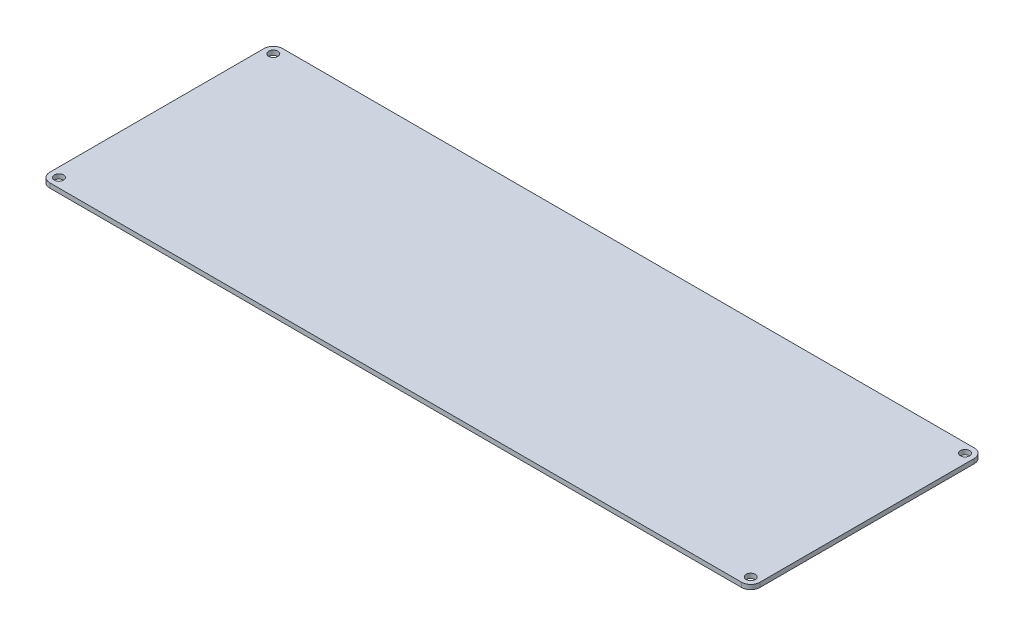
ISO-10303-21;
HEADER;
FILE_DESCRIPTION(('STEP AP214'),'2;1');
FILE_NAME('part.step','',(''),(''),'','','');
FILE_SCHEMA(('AUTOMOTIVE_DESIGN { 1 0 10303 214 1 1 1 1 }'));
ENDSEC;
DATA;
#1=APPLICATION_CONTEXT('core data for automotive mechanical design processes');
#2=APPLICATION_PROTOCOL_DEFINITION('international standard','automotive_design',2000,#1);
#3=PRODUCT_CONTEXT('',#1,'mechanical');
#4=PRODUCT('Part','Part','',(#3));
#5=PRODUCT_RELATED_PRODUCT_CATEGORY('part','',(#4));
#6=PRODUCT_DEFINITION_FORMATION('','',#4);
#7=PRODUCT_DEFINITION_CONTEXT('part definition',#1,'design');
#8=PRODUCT_DEFINITION('design','',#6,#7);
#9=PRODUCT_DEFINITION_SHAPE('','',#8);
#10=(LENGTH_UNIT() NAMED_UNIT(*) SI_UNIT(.MILLI.,.METRE.));
#11=(NAMED_UNIT(*) PLANE_ANGLE_UNIT() SI_UNIT($,.RADIAN.));
#12=(NAMED_UNIT(*) SI_UNIT($,.STERADIAN.) SOLID_ANGLE_UNIT());
#13=UNCERTAINTY_MEASURE_WITH_UNIT(LENGTH_MEASURE(1.E-05),#10,'distance_accuracy_value','');
#14=(GEOMETRIC_REPRESENTATION_CONTEXT(3) GLOBAL_UNCERTAINTY_ASSIGNED_CONTEXT((#13)) GLOBAL_UNIT_ASSIGNED_CONTEXT((#10,
#11,#12)) REPRESENTATION_CONTEXT('',''));
#15=CARTESIAN_POINT('',(0.,0.,0.));
#16=DIRECTION('',(0.,0.,1.));
#17=DIRECTION('',(1.,0.,0.));
#18=AXIS2_PLACEMENT_3D('',#15,#16,#17);
#19=CARTESIAN_POINT('',(333.951461861864,-3.175,2.30598326968362E-13));
#20=DIRECTION('',(-1.,0.,0.));
#21=DIRECTION('',(0.,0.,1.));
#22=AXIS2_PLACEMENT_3D('',#19,#20,#21);
#23=PLANE('',#22);
#24=DIRECTION('',(0.,0.,1.));
#25=VECTOR('',#24,1.);
#26=CARTESIAN_POINT('',(333.951461861864,0.,2.30598326968362E-13));
#27=LINE('',#26,#25);
#28=CARTESIAN_POINT('',(333.951461861864,0.,-179.947050824412));
#29=VERTEX_POINT('',#28);
#30=CARTESIAN_POINT('',(333.951461861864,0.,-31.8650508244125));
#31=VERTEX_POINT('',#30);
#32=EDGE_CURVE('E128',#29,#31,#27,.T.);
#33=ORIENTED_EDGE('',*,*,#32,.T.);
#34=DIRECTION('',(0.,1.,0.));
#35=VECTOR('',#34,1.);
#36=CARTESIAN_POINT('',(333.951461861864,-3.175,-31.8650508244125));
#37=LINE('',#36,#35);
#38=CARTESIAN_POINT('',(333.951461861864,-3.175,-31.8650508244125));
#39=VERTEX_POINT('',#38);
#40=EDGE_CURVE('E11',#31,#39,#37,.F.);
#41=ORIENTED_EDGE('',*,*,#40,.T.);
#42=DIRECTION('',(0.,0.,1.));
#43=VECTOR('',#42,1.);
#44=CARTESIAN_POINT('',(333.951461861864,-3.175,2.30598326968362E-13));
#45=LINE('',#44,#43);
#46=CARTESIAN_POINT('',(333.951461861864,-3.175,-179.947050824412));
#47=VERTEX_POINT('',#46);
#48=EDGE_CURVE('E164',#47,#39,#45,.T.);
#49=ORIENTED_EDGE('',*,*,#48,.F.);
#50=DIRECTION('',(0.,1.,0.));
#51=VECTOR('',#50,1.);
#52=CARTESIAN_POINT('',(333.951461861864,-3.175,-179.947050824412));
#53=LINE('',#52,#51);
#54=EDGE_CURVE('E43',#47,#29,#53,.T.);
#55=ORIENTED_EDGE('',*,*,#54,.T.);
#56=EDGE_LOOP('',(#33,#41,#49,#55));
#57=FACE_BOUND('',#56,.T.);
#58=ADVANCED_FACE('F35',(#57),#23,.F.);
#59=CARTESIAN_POINT('',(0.,-3.175,-25.5150508244125));
#60=DIRECTION('',(0.,0.,1.));
#61=DIRECTION('',(1.,0.,0.));
#62=AXIS2_PLACEMENT_3D('',#59,#60,#61);
#63=PLANE('',#62);
#64=DIRECTION('',(1.,0.,0.));
#65=VECTOR('',#64,1.);
#66=CARTESIAN_POINT('',(0.,0.,-25.5150508244125));
#67=LINE('',#66,#65);
#68=CARTESIAN_POINT('',(-150.418538510136,0.,-25.5150508244125));
#69=VERTEX_POINT('',#68);
#70=CARTESIAN_POINT('',(327.601461861864,0.,-25.5150508244125));
#71=VERTEX_POINT('',#70);
#72=EDGE_CURVE('E130',#69,#71,#67,.T.);
#73=ORIENTED_EDGE('',*,*,#72,.F.);
#74=DIRECTION('',(0.,1.,0.));
#75=VECTOR('',#74,1.);
#76=CARTESIAN_POINT('',(-150.418538510136,-3.175,-25.5150508244125));
#77=LINE('',#76,#75);
#78=CARTESIAN_POINT('',(-150.418538510136,-3.175,-25.5150508244125));
#79=VERTEX_POINT('',#78);
#80=EDGE_CURVE('E57',#69,#79,#77,.F.);
#81=ORIENTED_EDGE('',*,*,#80,.T.);
#82=DIRECTION('',(1.,0.,0.));
#83=VECTOR('',#82,1.);
#84=CARTESIAN_POINT('',(0.,-3.175,-25.5150508244125));
#85=LINE('',#84,#83);
#86=CARTESIAN_POINT('',(327.601461861864,-3.175,-25.5150508244125));
#87=VERTEX_POINT('',#86);
#88=EDGE_CURVE('E140',#79,#87,#85,.T.);
#89=ORIENTED_EDGE('',*,*,#88,.T.);
#90=DIRECTION('',(0.,1.,0.));
#91=VECTOR('',#90,1.);
#92=CARTESIAN_POINT('',(327.601461861864,0.,-25.5150508244125));
#93=LINE('',#92,#91);
#94=EDGE_CURVE('E156',#87,#71,#93,.T.);
#95=ORIENTED_EDGE('',*,*,#94,.T.);
#96=EDGE_LOOP('',(#73,#81,#89,#95));
#97=FACE_BOUND('',#96,.T.);
#98=ADVANCED_FACE('F170',(#97),#63,.T.);
#99=CARTESIAN_POINT('',(-156.768538510136,-3.175,1.0825094910549E-13));
#100=DIRECTION('',(-1.,0.,0.));
#101=DIRECTION('',(0.,0.,1.));
#102=AXIS2_PLACEMENT_3D('',#99,#100,#101);
#103=PLANE('',#102);
#104=DIRECTION('',(0.,0.,1.));
#105=VECTOR('',#104,1.);
#106=CARTESIAN_POINT('',(-156.768538510136,0.,1.0825094910549E-13));
#107=LINE('',#106,#105);
#108=CARTESIAN_POINT('',(-156.768538510136,0.,-179.947050824412));
#109=VERTEX_POINT('',#108);
#110=CARTESIAN_POINT('',(-156.768538510136,0.,-31.8650508244125));
#111=VERTEX_POINT('',#110);
#112=EDGE_CURVE('E127',#109,#111,#107,.T.);
#113=ORIENTED_EDGE('',*,*,#112,.F.);
#114=DIRECTION('',(0.,1.,0.));
#115=VECTOR('',#114,1.);
#116=CARTESIAN_POINT('',(-156.768538510136,-3.175,-179.947050824412));
#117=LINE('',#116,#115);
#118=CARTESIAN_POINT('',(-156.768538510136,-3.175,-179.947050824412));
#119=VERTEX_POINT('',#118);
#120=EDGE_CURVE('E106',#109,#119,#117,.F.);
#121=ORIENTED_EDGE('',*,*,#120,.T.);
#122=DIRECTION('',(0.,0.,1.));
#123=VECTOR('',#122,1.);
#124=CARTESIAN_POINT('',(-156.768538510136,-3.175,1.0825094910549E-13));
#125=LINE('',#124,#123);
#126=CARTESIAN_POINT('',(-156.768538510136,-3.175,-31.8650508244125));
#127=VERTEX_POINT('',#126);
#128=EDGE_CURVE('E172',#119,#127,#125,.T.);
#129=ORIENTED_EDGE('',*,*,#128,.T.);
#130=DIRECTION('',(0.,1.,0.));
#131=VECTOR('',#130,1.);
#132=CARTESIAN_POINT('',(-156.768538510136,-3.175,-31.8650508244125));
#133=LINE('',#132,#131);
#134=EDGE_CURVE('E111',#127,#111,#133,.T.);
#135=ORIENTED_EDGE('',*,*,#134,.T.);
#136=EDGE_LOOP('',(#113,#121,#129,#135));
#137=FACE_BOUND('',#136,.T.);
#138=ADVANCED_FACE('F211',(#137),#103,.T.);
#139=CARTESIAN_POINT('',(-150.418538510136,-3.175,-179.947050824412));
#140=DIRECTION('',(0.,1.,0.));
#141=DIRECTION('',(0.,0.,1.));
#142=AXIS2_PLACEMENT_3D('',#139,#140,#141);
#143=CYLINDRICAL_SURFACE('',#142,3.175);
#144=CARTESIAN_POINT('',(-150.418538510136,-3.175,-179.947050824412));
#145=DIRECTION('',(0.,1.,0.));
#146=DIRECTION('',(0.,0.,1.));
#147=AXIS2_PLACEMENT_3D('',#144,#145,#146);
#148=CIRCLE('',#147,3.175);
#149=CARTESIAN_POINT('',(-150.418538510136,-3.175,-176.772050824412));
#150=VERTEX_POINT('',#149);
#151=EDGE_CURVE('E239',#150,#150,#148,.T.);
#152=ORIENTED_EDGE('',*,*,#151,.F.);
#153=EDGE_LOOP('',(#152));
#154=FACE_BOUND('',#153,.T.);
#155=CARTESIAN_POINT('',(-150.418538510136,0.,-179.947050824412));
#156=DIRECTION('',(0.,1.,0.));
#157=DIRECTION('',(0.,0.,1.));
#158=AXIS2_PLACEMENT_3D('',#155,#156,#157);
#159=CIRCLE('',#158,3.175);
#160=CARTESIAN_POINT('',(-150.418538510136,0.,-176.772050824412));
#161=VERTEX_POINT('',#160);
#162=EDGE_CURVE('E133',#161,#161,#159,.T.);
#163=ORIENTED_EDGE('',*,*,#162,.T.);
#164=EDGE_LOOP('',(#163));
#165=FACE_BOUND('',#164,.T.);
#166=ADVANCED_FACE('F189',(#154,#165),#143,.F.);
#167=CARTESIAN_POINT('',(-150.418538510136,-3.175,-31.8650508244125));
#168=DIRECTION('',(0.,1.,0.));
#169=DIRECTION('',(0.,0.,1.));
#170=AXIS2_PLACEMENT_3D('',#167,#168,#169);
#171=CYLINDRICAL_SURFACE('',#170,3.17499999999997);
#172=CARTESIAN_POINT('',(-150.418538510136,-3.175,-31.8650508244125));
#173=DIRECTION('',(0.,1.,0.));
#174=DIRECTION('',(0.,0.,1.));
#175=AXIS2_PLACEMENT_3D('',#172,#173,#174);
#176=CIRCLE('',#175,3.17499999999997);
#177=CARTESIAN_POINT('',(-150.418538510136,-3.175,-28.6900508244125));
#178=VERTEX_POINT('',#177);
#179=EDGE_CURVE('E244',#178,#178,#176,.T.);
#180=ORIENTED_EDGE('',*,*,#179,.F.);
#181=EDGE_LOOP('',(#180));
#182=FACE_BOUND('',#181,.T.);
#183=CARTESIAN_POINT('',(-150.418538510136,0.,-31.8650508244125));
#184=DIRECTION('',(0.,1.,0.));
#185=DIRECTION('',(0.,0.,1.));
#186=AXIS2_PLACEMENT_3D('',#183,#184,#185);
#187=CIRCLE('',#186,3.17499999999997);
#188=CARTESIAN_POINT('',(-150.418538510136,0.,-28.6900508244125));
#189=VERTEX_POINT('',#188);
#190=EDGE_CURVE('E184',#189,#189,#187,.T.);
#191=ORIENTED_EDGE('',*,*,#190,.T.);
#192=EDGE_LOOP('',(#191));
#193=FACE_BOUND('',#192,.T.);
#194=ADVANCED_FACE('F217',(#182,#193),#171,.F.);
#195=CARTESIAN_POINT('',(327.601461861864,-3.175,-31.8650508244125));
#196=DIRECTION('',(0.,1.,0.));
#197=DIRECTION('',(0.,0.,1.));
#198=AXIS2_PLACEMENT_3D('',#195,#196,#197);
#199=CYLINDRICAL_SURFACE('',#198,3.17499999999997);
#200=CARTESIAN_POINT('',(327.601461861864,-3.175,-31.8650508244125));
#201=DIRECTION('',(0.,1.,0.));
#202=DIRECTION('',(0.,0.,1.));
#203=AXIS2_PLACEMENT_3D('',#200,#201,#202);
#204=CIRCLE('',#203,3.17499999999997);
#205=CARTESIAN_POINT('',(327.601461861864,-3.175,-28.6900508244125));
#206=VERTEX_POINT('',#205);
#207=EDGE_CURVE('E247',#206,#206,#204,.T.);
#208=ORIENTED_EDGE('',*,*,#207,.F.);
#209=EDGE_LOOP('',(#208));
#210=FACE_BOUND('',#209,.T.);
#211=CARTESIAN_POINT('',(327.601461861864,0.,-31.8650508244125));
#212=DIRECTION('',(0.,1.,0.));
#213=DIRECTION('',(0.,0.,1.));
#214=AXIS2_PLACEMENT_3D('',#211,#212,#213);
#215=CIRCLE('',#214,3.17499999999997);
#216=CARTESIAN_POINT('',(327.601461861864,0.,-28.6900508244125));
#217=VERTEX_POINT('',#216);
#218=EDGE_CURVE('E181',#217,#217,#215,.T.);
#219=ORIENTED_EDGE('',*,*,#218,.T.);
#220=EDGE_LOOP('',(#219));
#221=FACE_BOUND('',#220,.T.);
#222=ADVANCED_FACE('F221',(#210,#221),#199,.F.);
#223=CARTESIAN_POINT('',(327.601461861864,-3.175,-179.947050824412));
#224=DIRECTION('',(0.,1.,0.));
#225=DIRECTION('',(0.,0.,1.));
#226=AXIS2_PLACEMENT_3D('',#223,#224,#225);
#227=CYLINDRICAL_SURFACE('',#226,3.17499999999997);
#228=CARTESIAN_POINT('',(327.601461861864,-3.175,-179.947050824412));
#229=DIRECTION('',(0.,1.,0.));
#230=DIRECTION('',(0.,0.,1.));
#231=AXIS2_PLACEMENT_3D('',#228,#229,#230);
#232=CIRCLE('',#231,3.17499999999997);
#233=CARTESIAN_POINT('',(327.601461861864,-3.175,-176.772050824412));
#234=VERTEX_POINT('',#233);
#235=EDGE_CURVE('E139',#234,#234,#232,.T.);
#236=ORIENTED_EDGE('',*,*,#235,.F.);
#237=EDGE_LOOP('',(#236));
#238=FACE_BOUND('',#237,.T.);
#239=CARTESIAN_POINT('',(327.601461861864,0.,-179.947050824412));
#240=DIRECTION('',(0.,1.,0.));
#241=DIRECTION('',(0.,0.,1.));
#242=AXIS2_PLACEMENT_3D('',#239,#240,#241);
#243=CIRCLE('',#242,3.17499999999997);
#244=CARTESIAN_POINT('',(327.601461861864,0.,-176.772050824412));
#245=VERTEX_POINT('',#244);
#246=EDGE_CURVE('E178',#245,#245,#243,.T.);
#247=ORIENTED_EDGE('',*,*,#246,.T.);
#248=EDGE_LOOP('',(#247));
#249=FACE_BOUND('',#248,.T.);
#250=ADVANCED_FACE('F225',(#238,#249),#227,.F.);
#251=CARTESIAN_POINT('',(0.,-3.175,-186.297050824412));
#252=DIRECTION('',(0.,0.,1.));
#253=DIRECTION('',(1.,0.,0.));
#254=AXIS2_PLACEMENT_3D('',#251,#252,#253);
#255=PLANE('',#254);
#256=DIRECTION('',(1.,0.,0.));
#257=VECTOR('',#256,1.);
#258=CARTESIAN_POINT('',(0.,-3.175,-186.297050824412));
#259=LINE('',#258,#257);
#260=CARTESIAN_POINT('',(-150.418538510136,-3.175,-186.297050824412));
#261=VERTEX_POINT('',#260);
#262=CARTESIAN_POINT('',(327.601461861864,-3.175,-186.297050824412));
#263=VERTEX_POINT('',#262);
#264=EDGE_CURVE('E121',#261,#263,#259,.T.);
#265=ORIENTED_EDGE('',*,*,#264,.F.);
#266=DIRECTION('',(0.,1.,0.));
#267=VECTOR('',#266,1.);
#268=CARTESIAN_POINT('',(-150.418538510136,0.,-186.297050824412));
#269=LINE('',#268,#267);
#270=CARTESIAN_POINT('',(-150.418538510136,0.,-186.297050824412));
#271=VERTEX_POINT('',#270);
#272=EDGE_CURVE('E105',#261,#271,#269,.T.);
#273=ORIENTED_EDGE('',*,*,#272,.T.);
#274=DIRECTION('',(1.,0.,0.));
#275=VECTOR('',#274,1.);
#276=CARTESIAN_POINT('',(0.,0.,-186.297050824412));
#277=LINE('',#276,#275);
#278=CARTESIAN_POINT('',(327.601461861864,0.,-186.297050824412));
#279=VERTEX_POINT('',#278);
#280=EDGE_CURVE('E118',#271,#279,#277,.T.);
#281=ORIENTED_EDGE('',*,*,#280,.T.);
#282=DIRECTION('',(0.,1.,0.));
#283=VECTOR('',#282,1.);
#284=CARTESIAN_POINT('',(327.601461861864,-3.175,-186.297050824412));
#285=LINE('',#284,#283);
#286=EDGE_CURVE('E123',#279,#263,#285,.F.);
#287=ORIENTED_EDGE('',*,*,#286,.T.);
#288=EDGE_LOOP('',(#265,#273,#281,#287));
#289=FACE_BOUND('',#288,.T.);
#290=ADVANCED_FACE('F117',(#289),#255,.F.);
#291=CARTESIAN_POINT('',(0.,-3.175,0.));
#292=DIRECTION('',(0.,1.,0.));
#293=DIRECTION('',(0.,0.,1.));
#294=AXIS2_PLACEMENT_3D('',#291,#292,#293);
#295=PLANE('',#294);
#296=ORIENTED_EDGE('',*,*,#235,.T.);
#297=EDGE_LOOP('',(#296));
#298=FACE_BOUND('',#297,.T.);
#299=ORIENTED_EDGE('',*,*,#207,.T.);
#300=EDGE_LOOP('',(#299));
#301=FACE_BOUND('',#300,.T.);
#302=ORIENTED_EDGE('',*,*,#179,.T.);
#303=EDGE_LOOP('',(#302));
#304=FACE_BOUND('',#303,.T.);
#305=ORIENTED_EDGE('',*,*,#151,.T.);
#306=EDGE_LOOP('',(#305));
#307=FACE_BOUND('',#306,.T.);
#308=ORIENTED_EDGE('',*,*,#128,.F.);
#309=CARTESIAN_POINT('',(-150.418538510136,-3.175,-179.947050824412));
#310=DIRECTION('',(0.,1.,0.));
#311=DIRECTION('',(0.,0.,1.));
#312=AXIS2_PLACEMENT_3D('',#309,#310,#311);
#313=CIRCLE('',#312,6.35);
#314=EDGE_CURVE('E154',#119,#261,#313,.F.);
#315=ORIENTED_EDGE('',*,*,#314,.T.);
#316=ORIENTED_EDGE('',*,*,#264,.T.);
#317=CARTESIAN_POINT('',(327.601461861864,-3.175,-179.947050824412));
#318=DIRECTION('',(0.,1.,0.));
#319=DIRECTION('',(0.,0.,1.));
#320=AXIS2_PLACEMENT_3D('',#317,#318,#319);
#321=CIRCLE('',#320,6.35);
#322=EDGE_CURVE('E149',#263,#47,#321,.F.);
#323=ORIENTED_EDGE('',*,*,#322,.T.);
#324=ORIENTED_EDGE('',*,*,#48,.T.);
#325=CARTESIAN_POINT('',(327.601461861864,-3.175,-31.8650508244125));
#326=DIRECTION('',(0.,1.,0.));
#327=DIRECTION('',(0.,0.,1.));
#328=AXIS2_PLACEMENT_3D('',#325,#326,#327);
#329=CIRCLE('',#328,6.35);
#330=EDGE_CURVE('E50',#39,#87,#329,.F.);
#331=ORIENTED_EDGE('',*,*,#330,.T.);
#332=ORIENTED_EDGE('',*,*,#88,.F.);
#333=CARTESIAN_POINT('',(-150.418538510136,-3.175,-31.8650508244125));
#334=DIRECTION('',(0.,1.,0.));
#335=DIRECTION('',(0.,0.,1.));
#336=AXIS2_PLACEMENT_3D('',#333,#334,#335);
#337=CIRCLE('',#336,6.35);
#338=EDGE_CURVE('E152',#79,#127,#337,.F.);
#339=ORIENTED_EDGE('',*,*,#338,.T.);
#340=EDGE_LOOP('',(#308,#315,#316,#323,#324,#331,#332,#339));
#341=FACE_BOUND('',#340,.T.);
#342=ADVANCED_FACE('F192',(#298,#301,#304,#307,#341),#295,.F.);
#343=CARTESIAN_POINT('',(0.,0.,0.));
#344=DIRECTION('',(0.,1.,0.));
#345=DIRECTION('',(0.,0.,1.));
#346=AXIS2_PLACEMENT_3D('',#343,#344,#345);
#347=PLANE('',#346);
#348=ORIENTED_EDGE('',*,*,#246,.F.);
#349=EDGE_LOOP('',(#348));
#350=FACE_BOUND('',#349,.T.);
#351=ORIENTED_EDGE('',*,*,#218,.F.);
#352=EDGE_LOOP('',(#351));
#353=FACE_BOUND('',#352,.T.);
#354=ORIENTED_EDGE('',*,*,#190,.F.);
#355=EDGE_LOOP('',(#354));
#356=FACE_BOUND('',#355,.T.);
#357=ORIENTED_EDGE('',*,*,#162,.F.);
#358=EDGE_LOOP('',(#357));
#359=FACE_BOUND('',#358,.T.);
#360=ORIENTED_EDGE('',*,*,#280,.F.);
#361=CARTESIAN_POINT('',(-150.418538510136,0.,-179.947050824412));
#362=DIRECTION('',(0.,1.,0.));
#363=DIRECTION('',(0.,0.,1.));
#364=AXIS2_PLACEMENT_3D('',#361,#362,#363);
#365=CIRCLE('',#364,6.35);
#366=EDGE_CURVE('E101',#271,#109,#365,.T.);
#367=ORIENTED_EDGE('',*,*,#366,.T.);
#368=ORIENTED_EDGE('',*,*,#112,.T.);
#369=CARTESIAN_POINT('',(-150.418538510136,0.,-31.8650508244125));
#370=DIRECTION('',(0.,1.,0.));
#371=DIRECTION('',(0.,0.,1.));
#372=AXIS2_PLACEMENT_3D('',#369,#370,#371);
#373=CIRCLE('',#372,6.35);
#374=EDGE_CURVE('E112',#111,#69,#373,.T.);
#375=ORIENTED_EDGE('',*,*,#374,.T.);
#376=ORIENTED_EDGE('',*,*,#72,.T.);
#377=CARTESIAN_POINT('',(327.601461861864,0.,-31.8650508244125));
#378=DIRECTION('',(0.,1.,0.));
#379=DIRECTION('',(0.,0.,1.));
#380=AXIS2_PLACEMENT_3D('',#377,#378,#379);
#381=CIRCLE('',#380,6.35);
#382=EDGE_CURVE('E143',#71,#31,#381,.T.);
#383=ORIENTED_EDGE('',*,*,#382,.T.);
#384=ORIENTED_EDGE('',*,*,#32,.F.);
#385=CARTESIAN_POINT('',(327.601461861864,0.,-179.947050824412));
#386=DIRECTION('',(0.,1.,0.));
#387=DIRECTION('',(0.,0.,1.));
#388=AXIS2_PLACEMENT_3D('',#385,#386,#387);
#389=CIRCLE('',#388,6.35);
#390=EDGE_CURVE('E122',#29,#279,#389,.T.);
#391=ORIENTED_EDGE('',*,*,#390,.T.);
#392=EDGE_LOOP('',(#360,#367,#368,#375,#376,#383,#384,#391));
#393=FACE_BOUND('',#392,.T.);
#394=ADVANCED_FACE('F125',(#350,#353,#356,#359,#393),#347,.T.);
#395=CARTESIAN_POINT('',(-150.418538510136,-3.175,-179.947050824412));
#396=DIRECTION('',(0.,-1.,0.));
#397=DIRECTION('',(0.,0.,-1.));
#398=AXIS2_PLACEMENT_3D('',#395,#396,#397);
#399=CYLINDRICAL_SURFACE('',#398,6.35);
#400=ORIENTED_EDGE('',*,*,#314,.F.);
#401=ORIENTED_EDGE('',*,*,#120,.F.);
#402=ORIENTED_EDGE('',*,*,#366,.F.);
#403=ORIENTED_EDGE('',*,*,#272,.F.);
#404=EDGE_LOOP('',(#400,#401,#402,#403));
#405=FACE_BOUND('',#404,.T.);
#406=ADVANCED_FACE('F104',(#405),#399,.T.);
#407=CARTESIAN_POINT('',(-150.418538510136,-3.175,-31.8650508244125));
#408=DIRECTION('',(0.,1.,0.));
#409=DIRECTION('',(0.,0.,1.));
#410=AXIS2_PLACEMENT_3D('',#407,#408,#409);
#411=CYLINDRICAL_SURFACE('',#410,6.35);
#412=ORIENTED_EDGE('',*,*,#338,.F.);
#413=ORIENTED_EDGE('',*,*,#80,.F.);
#414=ORIENTED_EDGE('',*,*,#374,.F.);
#415=ORIENTED_EDGE('',*,*,#134,.F.);
#416=EDGE_LOOP('',(#412,#413,#414,#415));
#417=FACE_BOUND('',#416,.T.);
#418=ADVANCED_FACE('F199',(#417),#411,.T.);
#419=CARTESIAN_POINT('',(327.601461861864,-3.175,-31.8650508244125));
#420=DIRECTION('',(0.,-1.,0.));
#421=DIRECTION('',(0.,0.,-1.));
#422=AXIS2_PLACEMENT_3D('',#419,#420,#421);
#423=CYLINDRICAL_SURFACE('',#422,6.35);
#424=ORIENTED_EDGE('',*,*,#330,.F.);
#425=ORIENTED_EDGE('',*,*,#40,.F.);
#426=ORIENTED_EDGE('',*,*,#382,.F.);
#427=ORIENTED_EDGE('',*,*,#94,.F.);
#428=EDGE_LOOP('',(#424,#425,#426,#427));
#429=FACE_BOUND('',#428,.T.);
#430=ADVANCED_FACE('F169',(#429),#423,.T.);
#431=CARTESIAN_POINT('',(327.601461861864,-3.175,-179.947050824412));
#432=DIRECTION('',(0.,1.,0.));
#433=DIRECTION('',(0.,0.,1.));
#434=AXIS2_PLACEMENT_3D('',#431,#432,#433);
#435=CYLINDRICAL_SURFACE('',#434,6.35);
#436=ORIENTED_EDGE('',*,*,#322,.F.);
#437=ORIENTED_EDGE('',*,*,#286,.F.);
#438=ORIENTED_EDGE('',*,*,#390,.F.);
#439=ORIENTED_EDGE('',*,*,#54,.F.);
#440=EDGE_LOOP('',(#436,#437,#438,#439));
#441=FACE_BOUND('',#440,.T.);
#442=ADVANCED_FACE('F37',(#441),#435,.T.);
#443=CLOSED_SHELL('',(#58,#98,#138,#166,#194,#222,#250,#290,#342,#394,#406,#418,#430,#442));
#444=MANIFOLD_SOLID_BREP('B2',#443);
#445=ADVANCED_BREP_SHAPE_REPRESENTATION('',(#18,#444),#14);
#446=SHAPE_DEFINITION_REPRESENTATION(#9,#445);
ENDSEC;
END-ISO-10303-21;
